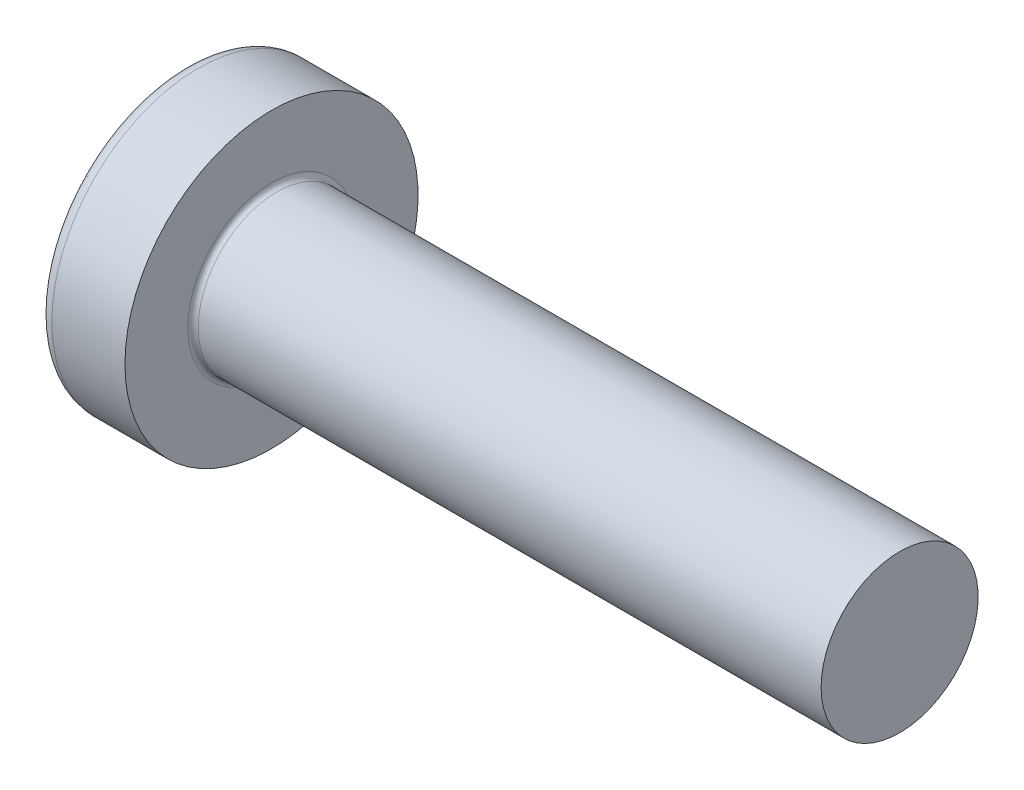
ISO-10303-21;
HEADER;
FILE_DESCRIPTION(('STEP AP214'),'2;1');
FILE_NAME('part.step','',(''),(''),'','','');
FILE_SCHEMA(('AUTOMOTIVE_DESIGN { 1 0 10303 214 1 1 1 1 }'));
ENDSEC;
DATA;
#1=APPLICATION_CONTEXT('core data for automotive mechanical design processes');
#2=APPLICATION_PROTOCOL_DEFINITION('international standard','automotive_design',2000,#1);
#3=PRODUCT_CONTEXT('',#1,'mechanical');
#4=PRODUCT('Part','Part','',(#3));
#5=PRODUCT_RELATED_PRODUCT_CATEGORY('part','',(#4));
#6=PRODUCT_DEFINITION_FORMATION('','',#4);
#7=PRODUCT_DEFINITION_CONTEXT('part definition',#1,'design');
#8=PRODUCT_DEFINITION('design','',#6,#7);
#9=PRODUCT_DEFINITION_SHAPE('','',#8);
#10=(LENGTH_UNIT() NAMED_UNIT(*) SI_UNIT(.MILLI.,.METRE.));
#11=(NAMED_UNIT(*) PLANE_ANGLE_UNIT() SI_UNIT($,.RADIAN.));
#12=(NAMED_UNIT(*) SI_UNIT($,.STERADIAN.) SOLID_ANGLE_UNIT());
#13=UNCERTAINTY_MEASURE_WITH_UNIT(LENGTH_MEASURE(1.E-05),#10,'distance_accuracy_value','');
#14=(GEOMETRIC_REPRESENTATION_CONTEXT(3) GLOBAL_UNCERTAINTY_ASSIGNED_CONTEXT((#13)) GLOBAL_UNIT_ASSIGNED_CONTEXT((#10,
#11,#12)) REPRESENTATION_CONTEXT('',''));
#15=CARTESIAN_POINT('',(0.,0.,0.));
#16=DIRECTION('',(0.,0.,1.));
#17=DIRECTION('',(1.,0.,0.));
#18=AXIS2_PLACEMENT_3D('',#15,#16,#17);
#19=CARTESIAN_POINT('',(5.,0.,0.));
#20=DIRECTION('',(-1.,0.,0.));
#21=DIRECTION('',(0.,1.,0.));
#22=AXIS2_PLACEMENT_3D('',#19,#20,#21);
#23=SPHERICAL_SURFACE('',#22,5.);
#24=CARTESIAN_POINT('',(0.775371598933733,0.,0.));
#25=DIRECTION('',(-1.,0.,0.));
#26=DIRECTION('',(0.,0.,1.));
#27=AXIS2_PLACEMENT_3D('',#24,#25,#26);
#28=CIRCLE('',#27,2.67441860465116);
#29=CARTESIAN_POINT('',(0.775371598933733,0.,2.67441860465116));
#30=VERTEX_POINT('',#29);
#31=EDGE_CURVE('E238',#30,#30,#28,.T.);
#32=ORIENTED_EDGE('',*,*,#31,.T.);
#33=EDGE_LOOP('',(#32));
#34=FACE_BOUND('',#33,.T.);
#35=CARTESIAN_POINT('',(0.0457951200896417,0.,0.));
#36=DIRECTION('',(1.,0.,0.));
#37=DIRECTION('',(0.,0.,-1.));
#38=AXIS2_PLACEMENT_3D('',#35,#36,#37);
#39=CIRCLE('',#38,0.675169614150692);
#40=CARTESIAN_POINT('',(0.0457951200896426,-0.369999999999998,-0.564760133040918));
#41=VERTEX_POINT('',#40);
#42=CARTESIAN_POINT('',(0.0457951200896417,-0.564760133040916,-0.37));
#43=VERTEX_POINT('',#42);
#44=EDGE_CURVE('E374',#41,#43,#39,.F.);
#45=ORIENTED_EDGE('',*,*,#44,.F.);
#46=CARTESIAN_POINT('',(5.,-0.37,0.));
#47=DIRECTION('',(0.,1.,0.));
#48=DIRECTION('',(0.,0.,1.));
#49=AXIS2_PLACEMENT_3D('',#46,#47,#48);
#50=CIRCLE('',#49,4.98629120689917);
#51=CARTESIAN_POINT('',(0.187869734228639,-0.369999999999995,-1.30633162146802));
#52=VERTEX_POINT('',#51);
#53=EDGE_CURVE('E300',#52,#41,#50,.T.);
#54=ORIENTED_EDGE('',*,*,#53,.F.);
#55=CARTESIAN_POINT('',(4.56358262530798,0.,0.875317983305919));
#56=DIRECTION('',(0.446197753347436,0.,-0.894934391398443));
#57=DIRECTION('',(-0.894934391398443,0.,-0.446197753347436));
#58=AXIS2_PLACEMENT_3D('',#55,#56,#57);
#59=CIRCLE('',#58,4.90340272700175);
#60=CARTESIAN_POINT('',(0.18786973422864,0.370000000000005,-1.30633162146802));
#61=VERTEX_POINT('',#60);
#62=EDGE_CURVE('E272',#52,#61,#59,.T.);
#63=ORIENTED_EDGE('',*,*,#62,.T.);
#64=CARTESIAN_POINT('',(5.,0.37,0.));
#65=DIRECTION('',(0.,-1.,0.));
#66=DIRECTION('',(0.,0.,-1.));
#67=AXIS2_PLACEMENT_3D('',#64,#65,#66);
#68=CIRCLE('',#67,4.98629120689917);
#69=CARTESIAN_POINT('',(0.0457951200896425,0.370000000000002,-0.564760133040916));
#70=VERTEX_POINT('',#69);
#71=EDGE_CURVE('E327',#70,#61,#68,.T.);
#72=ORIENTED_EDGE('',*,*,#71,.F.);
#73=CARTESIAN_POINT('',(0.0457951200896417,0.564760133040915,-0.37));
#74=VERTEX_POINT('',#73);
#75=EDGE_CURVE('E393',#74,#70,#39,.F.);
#76=ORIENTED_EDGE('',*,*,#75,.F.);
#77=CARTESIAN_POINT('',(5.,0.,-0.37));
#78=DIRECTION('',(0.,0.,1.));
#79=DIRECTION('',(1.,0.,0.));
#80=AXIS2_PLACEMENT_3D('',#77,#78,#79);
#81=CIRCLE('',#80,4.98629120689917);
#82=CARTESIAN_POINT('',(0.18786973422864,1.30633162146802,-0.37));
#83=VERTEX_POINT('',#82);
#84=EDGE_CURVE('E266',#83,#74,#81,.T.);
#85=ORIENTED_EDGE('',*,*,#84,.F.);
#86=CARTESIAN_POINT('',(4.56358262530798,-0.87531798330592,0.));
#87=DIRECTION('',(0.446197753347436,0.894934391398443,0.));
#88=DIRECTION('',(-0.894934391398442,0.446197753347436,0.));
#89=AXIS2_PLACEMENT_3D('',#86,#87,#88);
#90=CIRCLE('',#89,4.90340272700175);
#91=CARTESIAN_POINT('',(0.18786973422864,1.30633162146802,0.37));
#92=VERTEX_POINT('',#91);
#93=EDGE_CURVE('E269',#83,#92,#90,.T.);
#94=ORIENTED_EDGE('',*,*,#93,.T.);
#95=CARTESIAN_POINT('',(5.,0.,0.37));
#96=DIRECTION('',(0.,0.,-1.));
#97=DIRECTION('',(0.,1.,0.));
#98=AXIS2_PLACEMENT_3D('',#95,#96,#97);
#99=CIRCLE('',#98,4.98629120689917);
#100=CARTESIAN_POINT('',(0.0457951200896417,0.564760133040915,0.37));
#101=VERTEX_POINT('',#100);
#102=EDGE_CURVE('E262',#101,#92,#99,.T.);
#103=ORIENTED_EDGE('',*,*,#102,.F.);
#104=CARTESIAN_POINT('',(0.0457951200896434,0.369999999999998,0.564760133040918));
#105=VERTEX_POINT('',#104);
#106=EDGE_CURVE('E392',#105,#101,#39,.F.);
#107=ORIENTED_EDGE('',*,*,#106,.F.);
#108=CARTESIAN_POINT('',(0.18786973422864,0.369999999999995,1.30633162146802));
#109=VERTEX_POINT('',#108);
#110=EDGE_CURVE('E282',#109,#105,#68,.T.);
#111=ORIENTED_EDGE('',*,*,#110,.F.);
#112=CARTESIAN_POINT('',(4.56358262530798,0.,-0.87531798330592));
#113=DIRECTION('',(0.446197753347436,0.,0.894934391398443));
#114=DIRECTION('',(0.894934391398442,0.,-0.446197753347436));
#115=AXIS2_PLACEMENT_3D('',#112,#113,#114);
#116=CIRCLE('',#115,4.90340272700175);
#117=CARTESIAN_POINT('',(0.18786973422864,-0.370000000000005,1.30633162146802));
#118=VERTEX_POINT('',#117);
#119=EDGE_CURVE('E49',#109,#118,#116,.T.);
#120=ORIENTED_EDGE('',*,*,#119,.T.);
#121=CARTESIAN_POINT('',(0.0457951200896421,-0.370000000000002,0.564760133040916));
#122=VERTEX_POINT('',#121);
#123=EDGE_CURVE('E279',#122,#118,#50,.T.);
#124=ORIENTED_EDGE('',*,*,#123,.F.);
#125=CARTESIAN_POINT('',(0.0457951200896417,-0.564760133040916,0.37));
#126=VERTEX_POINT('',#125);
#127=EDGE_CURVE('E432',#126,#122,#39,.F.);
#128=ORIENTED_EDGE('',*,*,#127,.F.);
#129=CARTESIAN_POINT('',(0.187869734228638,-1.30633162146802,0.37));
#130=VERTEX_POINT('',#129);
#131=EDGE_CURVE('E263',#130,#126,#99,.T.);
#132=ORIENTED_EDGE('',*,*,#131,.F.);
#133=CARTESIAN_POINT('',(4.56358262530798,0.875317983305919,0.));
#134=DIRECTION('',(0.446197753347436,-0.894934391398443,0.));
#135=DIRECTION('',(0.894934391398443,0.446197753347436,0.));
#136=AXIS2_PLACEMENT_3D('',#133,#134,#135);
#137=CIRCLE('',#136,4.90340272700175);
#138=CARTESIAN_POINT('',(0.187869734228639,-1.30633162146802,-0.37));
#139=VERTEX_POINT('',#138);
#140=EDGE_CURVE('E259',#130,#139,#137,.T.);
#141=ORIENTED_EDGE('',*,*,#140,.T.);
#142=EDGE_CURVE('E64',#43,#139,#81,.T.);
#143=ORIENTED_EDGE('',*,*,#142,.F.);
#144=EDGE_LOOP('',(#45,#54,#63,#72,#76,#85,#94,#103,#107,#111,#120,#124,#128,#132,#141,#143));
#145=FACE_BOUND('',#144,.T.);
#146=ADVANCED_FACE('F35',(#34,#145),#23,.T.);
#147=CARTESIAN_POINT('',(1.75,0.527482331818931,-0.37));
#148=DIRECTION('',(0.,0.,1.));
#149=DIRECTION('',(1.,0.,0.));
#150=AXIS2_PLACEMENT_3D('',#147,#148,#149);
#151=PLANE('',#150);
#152=ORIENTED_EDGE('',*,*,#84,.T.);
#153=CARTESIAN_POINT('',(-0.987293237053716,0.649401255967161,-0.37));
#154=CARTESIAN_POINT('',(-0.781914975317084,0.632865887002871,-0.37));
#155=CARTESIAN_POINT('',(-0.576547882393372,0.616188977635081,-0.37));
#156=CARTESIAN_POINT('',(-0.165841599226327,0.582441031964227,-0.37));
#157=CARTESIAN_POINT('',(0.0394975903090452,0.56536998705488,-0.37));
#158=CARTESIAN_POINT('',(0.450133475422572,0.530723441326535,-0.37));
#159=CARTESIAN_POINT('',(0.655430171010573,0.513147940624557,-0.37));
#160=CARTESIAN_POINT('',(1.06596140177934,0.477314957985794,-0.37));
#161=CARTESIAN_POINT('',(1.2711959378071,0.459057485806066,-0.37));
#162=CARTESIAN_POINT('',(1.61065292365626,0.428051938688768,-0.37));
#163=CARTESIAN_POINT('',(1.74490059995643,0.415580824990931,-0.37));
#164=CARTESIAN_POINT('',(2.01334321762763,0.390092023404979,-0.37));
#165=CARTESIAN_POINT('',(2.14753815934577,0.377074339177353,-0.37));
#166=CARTESIAN_POINT('',(2.41586354151957,0.350315629452843,-0.37));
#167=CARTESIAN_POINT('',(2.5499939784531,0.33657456817765,-0.37));
#168=CARTESIAN_POINT('',(2.81814173295471,0.308004077741875,-0.37));
#169=CARTESIAN_POINT('',(2.95215904765134,0.293174621747065,-0.37));
#170=CARTESIAN_POINT('',(3.0860955068368,0.277618485071816,-0.37));
#171=B_SPLINE_CURVE_WITH_KNOTS('',3,(#153,#154,#155,#156,#157,#158,#159,#160,#161,#162,#163,
#164,#165,#166,#167,#168,#169,#170),.UNSPECIFIED.,.F.,.F.,(4,2,2,2,2,2,2,2,4),(0.,
0.618128793984691,1.23627109812525,1.85441325887562,2.4725465791681,2.87702276218609,
3.28149623678161,3.68598973550942,4.09049321032311),.UNSPECIFIED.);
#172=CARTESIAN_POINT('',(1.75,0.415013252800437,-0.370000000000001));
#173=VERTEX_POINT('',#172);
#174=EDGE_CURVE('E416',#74,#173,#171,.T.);
#175=ORIENTED_EDGE('',*,*,#174,.T.);
#176=DIRECTION('',(0.,1.,0.));
#177=VECTOR('',#176,1.);
#178=CARTESIAN_POINT('',(1.75,-0.527482331818931,-0.37));
#179=LINE('',#178,#177);
#180=CARTESIAN_POINT('',(1.75,0.527482331818931,-0.37));
#181=VERTEX_POINT('',#180);
#182=EDGE_CURVE('E356',#173,#181,#179,.T.);
#183=ORIENTED_EDGE('',*,*,#182,.T.);
#184=DIRECTION('',(0.894934391398442,-0.446197753347436,0.));
#185=VECTOR('',#184,1.);
#186=CARTESIAN_POINT('',(0.,1.4,-0.37));
#187=LINE('',#186,#185);
#188=EDGE_CURVE('E239',#83,#181,#187,.T.);
#189=ORIENTED_EDGE('',*,*,#188,.F.);
#190=EDGE_LOOP('',(#152,#175,#183,#189));
#191=FACE_BOUND('',#190,.T.);
#192=ADVANCED_FACE('F194',(#191),#151,.T.);
#193=CARTESIAN_POINT('',(1.75,-0.527482331818931,-0.37));
#194=VERTEX_POINT('',#193);
#195=CARTESIAN_POINT('',(1.75,-0.415013252800437,-0.370000000000001));
#196=VERTEX_POINT('',#195);
#197=EDGE_CURVE('E247',#194,#196,#179,.T.);
#198=ORIENTED_EDGE('',*,*,#197,.T.);
#199=CARTESIAN_POINT('',(-0.987293237053716,-0.649401255967161,-0.37));
#200=CARTESIAN_POINT('',(-0.781914975317084,-0.632865887002871,-0.37));
#201=CARTESIAN_POINT('',(-0.576547882393372,-0.616188977635081,-0.37));
#202=CARTESIAN_POINT('',(-0.165841599226327,-0.582441031964227,-0.37));
#203=CARTESIAN_POINT('',(0.0394975903090452,-0.56536998705488,-0.37));
#204=CARTESIAN_POINT('',(0.450133475422572,-0.530723441326535,-0.37));
#205=CARTESIAN_POINT('',(0.655430171010573,-0.513147940624557,-0.37));
#206=CARTESIAN_POINT('',(1.06596140177934,-0.477314957985794,-0.37));
#207=CARTESIAN_POINT('',(1.2711959378071,-0.459057485806066,-0.37));
#208=CARTESIAN_POINT('',(1.61065292365626,-0.428051938688768,-0.37));
#209=CARTESIAN_POINT('',(1.74490059995643,-0.415580824990931,-0.37));
#210=CARTESIAN_POINT('',(2.01334321762763,-0.390092023404979,-0.37));
#211=CARTESIAN_POINT('',(2.14753815934577,-0.377074339177353,-0.37));
#212=CARTESIAN_POINT('',(2.41586354151957,-0.350315629452843,-0.37));
#213=CARTESIAN_POINT('',(2.5499939784531,-0.33657456817765,-0.37));
#214=CARTESIAN_POINT('',(2.81814173295471,-0.308004077741875,-0.37));
#215=CARTESIAN_POINT('',(2.95215904765134,-0.293174621747065,-0.37));
#216=CARTESIAN_POINT('',(3.0860955068368,-0.277618485071816,-0.37));
#217=B_SPLINE_CURVE_WITH_KNOTS('',3,(#199,#200,#201,#202,#203,#204,#205,#206,#207,#208,#209,
#210,#211,#212,#213,#214,#215,#216),.UNSPECIFIED.,.F.,.F.,(4,2,2,2,2,2,2,2,4),(0.,
0.618128793984691,1.23627109812525,1.85441325887562,2.4725465791681,2.87702276218609,
3.28149623678161,3.68598973550942,4.09049321032311),.UNSPECIFIED.);
#218=EDGE_CURVE('E391',#196,#43,#217,.F.);
#219=ORIENTED_EDGE('',*,*,#218,.T.);
#220=ORIENTED_EDGE('',*,*,#142,.T.);
#221=DIRECTION('',(0.894934391398442,0.446197753347436,0.));
#222=VECTOR('',#221,1.);
#223=CARTESIAN_POINT('',(0.,-1.4,-0.37));
#224=LINE('',#223,#222);
#225=EDGE_CURVE('E330',#139,#194,#224,.T.);
#226=ORIENTED_EDGE('',*,*,#225,.T.);
#227=EDGE_LOOP('',(#198,#219,#220,#226));
#228=FACE_BOUND('',#227,.T.);
#229=ADVANCED_FACE('F200',(#228),#151,.T.);
#230=CARTESIAN_POINT('',(1.75,-0.527482331818931,0.37));
#231=DIRECTION('',(0.,0.,-1.));
#232=DIRECTION('',(0.,1.,0.));
#233=AXIS2_PLACEMENT_3D('',#230,#231,#232);
#234=PLANE('',#233);
#235=DIRECTION('',(0.,-1.,0.));
#236=VECTOR('',#235,1.);
#237=CARTESIAN_POINT('',(1.75,0.527482331818931,0.37));
#238=LINE('',#237,#236);
#239=CARTESIAN_POINT('',(1.75,0.527482331818931,0.37));
#240=VERTEX_POINT('',#239);
#241=CARTESIAN_POINT('',(1.75,0.415013252800437,0.370000000000001));
#242=VERTEX_POINT('',#241);
#243=EDGE_CURVE('E339',#240,#242,#238,.T.);
#244=ORIENTED_EDGE('',*,*,#243,.T.);
#245=CARTESIAN_POINT('',(-0.987293237053716,0.649401255967161,0.37));
#246=CARTESIAN_POINT('',(-0.781914975317084,0.632865887002871,0.37));
#247=CARTESIAN_POINT('',(-0.576547882393372,0.616188977635081,0.37));
#248=CARTESIAN_POINT('',(-0.165841599226327,0.582441031964227,0.37));
#249=CARTESIAN_POINT('',(0.0394975903090453,0.56536998705488,0.37));
#250=CARTESIAN_POINT('',(0.450133475422572,0.530723441326535,0.37));
#251=CARTESIAN_POINT('',(0.655430171010574,0.513147940624557,0.37));
#252=CARTESIAN_POINT('',(1.06596140177934,0.477314957985794,0.37));
#253=CARTESIAN_POINT('',(1.2711959378071,0.459057485806066,0.37));
#254=CARTESIAN_POINT('',(1.61065292365626,0.428051938688768,0.37));
#255=CARTESIAN_POINT('',(1.74490059995643,0.415580824990931,0.37));
#256=CARTESIAN_POINT('',(2.01334321762763,0.39009202340498,0.37));
#257=CARTESIAN_POINT('',(2.14753815934577,0.377074339177353,0.37));
#258=CARTESIAN_POINT('',(2.41586354151957,0.350315629452843,0.37));
#259=CARTESIAN_POINT('',(2.5499939784531,0.33657456817765,0.37));
#260=CARTESIAN_POINT('',(2.81814173295471,0.308004077741875,0.37));
#261=CARTESIAN_POINT('',(2.95215904765134,0.293174621747065,0.37));
#262=CARTESIAN_POINT('',(3.0860955068368,0.277618485071816,0.37));
#263=B_SPLINE_CURVE_WITH_KNOTS('',3,(#245,#246,#247,#248,#249,#250,#251,#252,#253,#254,#255,
#256,#257,#258,#259,#260,#261,#262),.UNSPECIFIED.,.F.,.F.,(4,2,2,2,2,2,2,2,4),(0.,
0.618128793984691,1.23627109812525,1.85441325887562,2.4725465791681,2.87702276218609,
3.28149623678161,3.68598973550942,4.09049321032311),.UNSPECIFIED.);
#264=EDGE_CURVE('E671',#242,#101,#263,.F.);
#265=ORIENTED_EDGE('',*,*,#264,.T.);
#266=ORIENTED_EDGE('',*,*,#102,.T.);
#267=DIRECTION('',(0.894934391398442,-0.446197753347436,0.));
#268=VECTOR('',#267,1.);
#269=CARTESIAN_POINT('',(0.,1.4,0.37));
#270=LINE('',#269,#268);
#271=EDGE_CURVE('E244',#92,#240,#270,.T.);
#272=ORIENTED_EDGE('',*,*,#271,.T.);
#273=EDGE_LOOP('',(#244,#265,#266,#272));
#274=FACE_BOUND('',#273,.T.);
#275=ADVANCED_FACE('F412',(#274),#234,.T.);
#276=ORIENTED_EDGE('',*,*,#131,.T.);
#277=CARTESIAN_POINT('',(-0.987293237069635,-0.649401255968442,0.37));
#278=CARTESIAN_POINT('',(-0.781914975331301,-0.632865887004023,0.37));
#279=CARTESIAN_POINT('',(-0.576547882405888,-0.616188977636102,0.37));
#280=CARTESIAN_POINT('',(-0.16584159923544,-0.582441031964983,0.37));
#281=CARTESIAN_POINT('',(0.0394975903016338,-0.5653699870555,0.37));
#282=CARTESIAN_POINT('',(0.450133475420601,-0.530723441326706,0.37));
#283=CARTESIAN_POINT('',(0.655430171012341,-0.513147940624409,0.37));
#284=CARTESIAN_POINT('',(1.06596140178858,-0.477314957984981,0.37));
#285=CARTESIAN_POINT('',(1.27119593782008,-0.459057485804908,0.37));
#286=CARTESIAN_POINT('',(1.61065292367297,-0.428051938687225,0.37));
#287=CARTESIAN_POINT('',(1.74490059997313,-0.415580824989368,0.37));
#288=CARTESIAN_POINT('',(2.01334321764434,-0.390092023403371,0.37));
#289=CARTESIAN_POINT('',(2.14753815936247,-0.377074339175718,0.37));
#290=CARTESIAN_POINT('',(2.41586354153627,-0.350315629451146,0.37));
#291=CARTESIAN_POINT('',(2.54999397846979,-0.336574568175918,0.37));
#292=CARTESIAN_POINT('',(2.8181417329714,-0.308004077740054,0.37));
#293=CARTESIAN_POINT('',(2.95215904766802,-0.29317462174519,0.37));
#294=CARTESIAN_POINT('',(3.08609550685347,-0.277618485069873,0.37));
#295=B_SPLINE_CURVE_WITH_KNOTS('',3,(#277,#278,#279,#280,#281,#282,#283,#284,#285,#286,#287,
#288,#289,#290,#291,#292,#293,#294),.UNSPECIFIED.,.F.,.F.,(4,2,2,2,2,2,2,2,4),(0.,
0.61812879398981,1.23627109813549,1.85441325889711,2.47254657920086,2.87702276221884,
3.28149623681437,3.68598973554218,4.09049321035586),.UNSPECIFIED.);
#296=CARTESIAN_POINT('',(1.75,-0.415013252800437,0.37));
#297=VERTEX_POINT('',#296);
#298=EDGE_CURVE('E433',#126,#297,#295,.T.);
#299=ORIENTED_EDGE('',*,*,#298,.T.);
#300=CARTESIAN_POINT('',(1.75,-0.527482331818932,0.37));
#301=VERTEX_POINT('',#300);
#302=EDGE_CURVE('E341',#297,#301,#238,.T.);
#303=ORIENTED_EDGE('',*,*,#302,.T.);
#304=DIRECTION('',(0.894934391398443,0.446197753347436,0.));
#305=VECTOR('',#304,1.);
#306=CARTESIAN_POINT('',(0.,-1.4,0.37));
#307=LINE('',#306,#305);
#308=EDGE_CURVE('E332',#130,#301,#307,.T.);
#309=ORIENTED_EDGE('',*,*,#308,.F.);
#310=EDGE_LOOP('',(#276,#299,#303,#309));
#311=FACE_BOUND('',#310,.T.);
#312=ADVANCED_FACE('F519',(#311),#234,.T.);
#313=CARTESIAN_POINT('',(1.75,0.527482331818931,0.37));
#314=DIRECTION('',(0.446197753347436,0.894934391398443,0.));
#315=DIRECTION('',(-0.894934391398442,0.446197753347436,0.));
#316=AXIS2_PLACEMENT_3D('',#313,#314,#315);
#317=PLANE('',#316);
#318=CARTESIAN_POINT('',(2.6696526882832,0.0689604923233249,0.));
#319=DIRECTION('',(0.446197753347436,0.894934391398443,0.));
#320=DIRECTION('',(-0.894934391398443,0.446197753347436,0.));
#321=AXIS2_PLACEMENT_3D('',#318,#319,#320);
#322=ELLIPSE('',#321,1.10195897609154,0.486831694838766);
#323=CARTESIAN_POINT('',(1.75,0.527482331818932,0.175779377683682));
#324=VERTEX_POINT('',#323);
#325=CARTESIAN_POINT('',(1.75,0.527482331818932,-0.175779377683682));
#326=VERTEX_POINT('',#325);
#327=EDGE_CURVE('E305',#324,#326,#322,.F.);
#328=ORIENTED_EDGE('',*,*,#327,.F.);
#329=DIRECTION('',(0.,0.,-1.));
#330=VECTOR('',#329,1.);
#331=CARTESIAN_POINT('',(1.75,0.527482331818931,0.37));
#332=LINE('',#331,#330);
#333=EDGE_CURVE('E342',#240,#324,#332,.T.);
#334=ORIENTED_EDGE('',*,*,#333,.F.);
#335=ORIENTED_EDGE('',*,*,#271,.F.);
#336=ORIENTED_EDGE('',*,*,#93,.F.);
#337=ORIENTED_EDGE('',*,*,#188,.T.);
#338=EDGE_CURVE('E344',#326,#181,#332,.T.);
#339=ORIENTED_EDGE('',*,*,#338,.F.);
#340=EDGE_LOOP('',(#328,#334,#335,#336,#337,#339));
#341=FACE_BOUND('',#340,.T.);
#342=ADVANCED_FACE('F410',(#341),#317,.F.);
#343=CARTESIAN_POINT('',(0.,-1.4,-0.37));
#344=DIRECTION('',(0.446197753347436,-0.894934391398443,0.));
#345=DIRECTION('',(0.894934391398443,0.446197753347436,0.));
#346=AXIS2_PLACEMENT_3D('',#343,#344,#345);
#347=PLANE('',#346);
#348=CARTESIAN_POINT('',(2.6696526882832,-0.0689604923233252,0.));
#349=DIRECTION('',(0.446197753347436,-0.894934391398443,0.));
#350=DIRECTION('',(-0.894934391398443,-0.446197753347436,0.));
#351=AXIS2_PLACEMENT_3D('',#348,#349,#350);
#352=ELLIPSE('',#351,1.10195897609154,0.486831694838766);
#353=CARTESIAN_POINT('',(1.75,-0.527482331818932,-0.175779377683681));
#354=VERTEX_POINT('',#353);
#355=CARTESIAN_POINT('',(1.75,-0.527482331818932,0.17577937768368));
#356=VERTEX_POINT('',#355);
#357=EDGE_CURVE('E673',#354,#356,#352,.F.);
#358=ORIENTED_EDGE('',*,*,#357,.F.);
#359=DIRECTION('',(0.,0.,1.));
#360=VECTOR('',#359,1.);
#361=CARTESIAN_POINT('',(1.75,-0.527482331818931,-0.37));
#362=LINE('',#361,#360);
#363=EDGE_CURVE('E335',#194,#354,#362,.T.);
#364=ORIENTED_EDGE('',*,*,#363,.F.);
#365=ORIENTED_EDGE('',*,*,#225,.F.);
#366=ORIENTED_EDGE('',*,*,#140,.F.);
#367=ORIENTED_EDGE('',*,*,#308,.T.);
#368=EDGE_CURVE('E338',#356,#301,#362,.T.);
#369=ORIENTED_EDGE('',*,*,#368,.F.);
#370=EDGE_LOOP('',(#358,#364,#365,#366,#367,#369));
#371=FACE_BOUND('',#370,.T.);
#372=ADVANCED_FACE('F506',(#371),#347,.F.);
#373=CARTESIAN_POINT('',(1.75,0.527482331818931,-0.37));
#374=DIRECTION('',(-1.,0.,0.));
#375=DIRECTION('',(0.,0.,1.));
#376=AXIS2_PLACEMENT_3D('',#373,#374,#375);
#377=PLANE('',#376);
#378=DIRECTION('',(0.,1.,0.));
#379=VECTOR('',#378,1.);
#380=CARTESIAN_POINT('',(1.75,-0.370000000000002,0.52748233181893));
#381=LINE('',#380,#379);
#382=CARTESIAN_POINT('',(1.75,-0.370000000000002,0.52748233181893));
#383=VERTEX_POINT('',#382);
#384=CARTESIAN_POINT('',(1.75,-0.175779377683686,0.52748233181893));
#385=VERTEX_POINT('',#384);
#386=EDGE_CURVE('E320',#383,#385,#381,.T.);
#387=ORIENTED_EDGE('',*,*,#386,.T.);
#388=CARTESIAN_POINT('',(1.75,0.,0.));
#389=DIRECTION('',(-1.,0.,0.));
#390=DIRECTION('',(0.,0.,1.));
#391=AXIS2_PLACEMENT_3D('',#388,#389,#390);
#392=CIRCLE('',#391,0.556);
#393=CARTESIAN_POINT('',(1.75,-0.370000000000001,0.415013252800436));
#394=VERTEX_POINT('',#393);
#395=EDGE_CURVE('E701',#394,#385,#392,.T.);
#396=ORIENTED_EDGE('',*,*,#395,.F.);
#397=DIRECTION('',(0.,0.,-1.));
#398=VECTOR('',#397,1.);
#399=CARTESIAN_POINT('',(1.75,-0.370000000000002,0.52748233181893));
#400=LINE('',#399,#398);
#401=EDGE_CURVE('E316',#383,#394,#400,.T.);
#402=ORIENTED_EDGE('',*,*,#401,.F.);
#403=EDGE_LOOP('',(#387,#396,#402));
#404=FACE_BOUND('',#403,.T.);
#405=ADVANCED_FACE('F499',(#404),#377,.T.);
#406=ORIENTED_EDGE('',*,*,#302,.F.);
#407=EDGE_CURVE('E706',#356,#297,#392,.T.);
#408=ORIENTED_EDGE('',*,*,#407,.F.);
#409=ORIENTED_EDGE('',*,*,#368,.T.);
#410=EDGE_LOOP('',(#406,#408,#409));
#411=FACE_BOUND('',#410,.T.);
#412=ADVANCED_FACE('F492',(#411),#377,.T.);
#413=ORIENTED_EDGE('',*,*,#363,.T.);
#414=EDGE_CURVE('E385',#196,#354,#392,.T.);
#415=ORIENTED_EDGE('',*,*,#414,.F.);
#416=ORIENTED_EDGE('',*,*,#197,.F.);
#417=EDGE_LOOP('',(#413,#415,#416));
#418=FACE_BOUND('',#417,.T.);
#419=ADVANCED_FACE('F486',(#418),#377,.T.);
#420=CARTESIAN_POINT('',(1.75,-0.369999999999998,-0.415013252800438));
#421=VERTEX_POINT('',#420);
#422=CARTESIAN_POINT('',(1.75,-0.369999999999998,-0.527482331818933));
#423=VERTEX_POINT('',#422);
#424=EDGE_CURVE('E319',#421,#423,#400,.T.);
#425=ORIENTED_EDGE('',*,*,#424,.F.);
#426=CARTESIAN_POINT('',(1.75,-0.17577937768368,-0.527482331818932));
#427=VERTEX_POINT('',#426);
#428=EDGE_CURVE('E56',#427,#421,#392,.T.);
#429=ORIENTED_EDGE('',*,*,#428,.F.);
#430=DIRECTION('',(0.,-1.,0.));
#431=VECTOR('',#430,1.);
#432=CARTESIAN_POINT('',(1.75,0.370000000000002,-0.52748233181893));
#433=LINE('',#432,#431);
#434=EDGE_CURVE('E315',#427,#423,#433,.T.);
#435=ORIENTED_EDGE('',*,*,#434,.T.);
#436=EDGE_LOOP('',(#425,#429,#435));
#437=FACE_BOUND('',#436,.T.);
#438=ADVANCED_FACE('F380',(#437),#377,.T.);
#439=CARTESIAN_POINT('',(1.75,0.370000000000002,-0.52748233181893));
#440=VERTEX_POINT('',#439);
#441=CARTESIAN_POINT('',(1.75,0.175779377683684,-0.527482331818931));
#442=VERTEX_POINT('',#441);
#443=EDGE_CURVE('E312',#440,#442,#433,.T.);
#444=ORIENTED_EDGE('',*,*,#443,.T.);
#445=CARTESIAN_POINT('',(1.75,0.370000000000001,-0.415013252800436));
#446=VERTEX_POINT('',#445);
#447=EDGE_CURVE('E384',#446,#442,#392,.T.);
#448=ORIENTED_EDGE('',*,*,#447,.F.);
#449=DIRECTION('',(0.,0.,1.));
#450=VECTOR('',#449,1.);
#451=CARTESIAN_POINT('',(1.75,0.370000000000002,-0.52748233181893));
#452=LINE('',#451,#450);
#453=EDGE_CURVE('E324',#440,#446,#452,.T.);
#454=ORIENTED_EDGE('',*,*,#453,.F.);
#455=EDGE_LOOP('',(#444,#448,#454));
#456=FACE_BOUND('',#455,.T.);
#457=ADVANCED_FACE('F474',(#456),#377,.T.);
#458=ORIENTED_EDGE('',*,*,#182,.F.);
#459=EDGE_CURVE('E690',#326,#173,#392,.T.);
#460=ORIENTED_EDGE('',*,*,#459,.F.);
#461=ORIENTED_EDGE('',*,*,#338,.T.);
#462=EDGE_LOOP('',(#458,#460,#461));
#463=FACE_BOUND('',#462,.T.);
#464=ADVANCED_FACE('F467',(#463),#377,.T.);
#465=ORIENTED_EDGE('',*,*,#333,.T.);
#466=EDGE_CURVE('E692',#242,#324,#392,.T.);
#467=ORIENTED_EDGE('',*,*,#466,.F.);
#468=ORIENTED_EDGE('',*,*,#243,.F.);
#469=EDGE_LOOP('',(#465,#467,#468));
#470=FACE_BOUND('',#469,.T.);
#471=ADVANCED_FACE('F461',(#470),#377,.T.);
#472=CARTESIAN_POINT('',(1.75,0.369999999999998,0.527482331818932));
#473=DIRECTION('',(0.,-1.,0.));
#474=DIRECTION('',(1.,0.,0.));
#475=AXIS2_PLACEMENT_3D('',#472,#473,#474);
#476=PLANE('',#475);
#477=ORIENTED_EDGE('',*,*,#110,.T.);
#478=CARTESIAN_POINT('',(-0.987293237069635,0.369999999999998,0.649401255968443));
#479=CARTESIAN_POINT('',(-0.781914975331301,0.369999999999998,0.632865887004024));
#480=CARTESIAN_POINT('',(-0.576547882405888,0.369999999999998,0.616188977636103));
#481=CARTESIAN_POINT('',(-0.16584159923544,0.369999999999998,0.582441031964984));
#482=CARTESIAN_POINT('',(0.0394975903016338,0.369999999999998,0.565369987055501));
#483=CARTESIAN_POINT('',(0.450133475420601,0.369999999999998,0.530723441326707));
#484=CARTESIAN_POINT('',(0.655430171012341,0.369999999999998,0.51314794062441));
#485=CARTESIAN_POINT('',(1.06596140178858,0.369999999999998,0.477314957984982));
#486=CARTESIAN_POINT('',(1.27119593782008,0.369999999999998,0.459057485804909));
#487=CARTESIAN_POINT('',(1.61065292367297,0.369999999999999,0.428051938687226));
#488=CARTESIAN_POINT('',(1.74490059997313,0.369999999999999,0.415580824989369));
#489=CARTESIAN_POINT('',(2.01334321764434,0.369999999999999,0.390092023403372));
#490=CARTESIAN_POINT('',(2.14753815936247,0.369999999999999,0.37707433917572));
#491=CARTESIAN_POINT('',(2.41586354153627,0.369999999999999,0.350315629451147));
#492=CARTESIAN_POINT('',(2.54999397846979,0.369999999999999,0.336574568175919));
#493=CARTESIAN_POINT('',(2.8181417329714,0.369999999999999,0.308004077740055));
#494=CARTESIAN_POINT('',(2.95215904766802,0.369999999999999,0.293174621745191));
#495=CARTESIAN_POINT('',(3.08609550685347,0.369999999999999,0.277618485069875));
#496=B_SPLINE_CURVE_WITH_KNOTS('',3,(#478,#479,#480,#481,#482,#483,#484,#485,#486,#487,#488,
#489,#490,#491,#492,#493,#494,#495),.UNSPECIFIED.,.F.,.F.,(4,2,2,2,2,2,2,2,4),(0.,
0.61812879398981,1.23627109813549,1.85441325889711,2.47254657920086,2.87702276221884,
3.28149623681436,3.68598973554218,4.09049321035586),.UNSPECIFIED.);
#497=CARTESIAN_POINT('',(1.75,0.369999999999999,0.415013252800439));
#498=VERTEX_POINT('',#497);
#499=EDGE_CURVE('E670',#105,#498,#496,.T.);
#500=ORIENTED_EDGE('',*,*,#499,.T.);
#501=CARTESIAN_POINT('',(1.75,0.369999999999998,0.527482331818932));
#502=VERTEX_POINT('',#501);
#503=EDGE_CURVE('E297',#498,#502,#452,.T.);
#504=ORIENTED_EDGE('',*,*,#503,.T.);
#505=DIRECTION('',(0.894934391398442,0.,-0.446197753347436));
#506=VECTOR('',#505,1.);
#507=CARTESIAN_POINT('',(0.,0.369999999999995,1.4));
#508=LINE('',#507,#506);
#509=EDGE_CURVE('E290',#109,#502,#508,.T.);
#510=ORIENTED_EDGE('',*,*,#509,.F.);
#511=EDGE_LOOP('',(#477,#500,#504,#510));
#512=FACE_BOUND('',#511,.T.);
#513=ADVANCED_FACE('F294',(#512),#476,.T.);
#514=CARTESIAN_POINT('',(1.75,-0.369999999999998,-0.527482331818933));
#515=DIRECTION('',(0.,1.,0.));
#516=DIRECTION('',(0.,0.,1.));
#517=AXIS2_PLACEMENT_3D('',#514,#515,#516);
#518=PLANE('',#517);
#519=ORIENTED_EDGE('',*,*,#401,.T.);
#520=CARTESIAN_POINT('',(-0.987293237053716,-0.370000000000002,0.64940125596716));
#521=CARTESIAN_POINT('',(-0.781914975317084,-0.370000000000002,0.63286588700287));
#522=CARTESIAN_POINT('',(-0.576547882393372,-0.370000000000002,0.61618897763508));
#523=CARTESIAN_POINT('',(-0.165841599226327,-0.370000000000002,0.582441031964225));
#524=CARTESIAN_POINT('',(0.0394975903090451,-0.370000000000002,0.565369987054878));
#525=CARTESIAN_POINT('',(0.450133475422572,-0.370000000000002,0.530723441326533));
#526=CARTESIAN_POINT('',(0.655430171010573,-0.370000000000002,0.513147940624555));
#527=CARTESIAN_POINT('',(1.06596140177934,-0.370000000000002,0.477314957985793));
#528=CARTESIAN_POINT('',(1.2711959378071,-0.370000000000002,0.459057485806065));
#529=CARTESIAN_POINT('',(1.61065292365626,-0.370000000000001,0.428051938688767));
#530=CARTESIAN_POINT('',(1.74490059995642,-0.370000000000001,0.41558082499093));
#531=CARTESIAN_POINT('',(2.01334321762763,-0.370000000000001,0.390092023404978));
#532=CARTESIAN_POINT('',(2.14753815934577,-0.370000000000001,0.377074339177352));
#533=CARTESIAN_POINT('',(2.41586354151957,-0.370000000000001,0.350315629452841));
#534=CARTESIAN_POINT('',(2.5499939784531,-0.370000000000001,0.336574568177649));
#535=CARTESIAN_POINT('',(2.81814173295471,-0.370000000000001,0.308004077741874));
#536=CARTESIAN_POINT('',(2.95215904765134,-0.370000000000001,0.293174621747063));
#537=CARTESIAN_POINT('',(3.0860955068368,-0.370000000000001,0.277618485071814));
#538=B_SPLINE_CURVE_WITH_KNOTS('',3,(#520,#521,#522,#523,#524,#525,#526,#527,#528,#529,#530,
#531,#532,#533,#534,#535,#536,#537),.UNSPECIFIED.,.F.,.F.,(4,2,2,2,2,2,2,2,4),(0.,
0.618128793984691,1.23627109812525,1.85441325887562,2.4725465791681,2.87702276218609,
3.28149623678161,3.68598973550942,4.09049321032311),.UNSPECIFIED.);
#539=EDGE_CURVE('E425',#394,#122,#538,.F.);
#540=ORIENTED_EDGE('',*,*,#539,.T.);
#541=ORIENTED_EDGE('',*,*,#123,.T.);
#542=DIRECTION('',(0.894934391398442,0.,-0.446197753347436));
#543=VECTOR('',#542,1.);
#544=CARTESIAN_POINT('',(0.,-0.370000000000005,1.4));
#545=LINE('',#544,#543);
#546=EDGE_CURVE('E292',#118,#383,#545,.T.);
#547=ORIENTED_EDGE('',*,*,#546,.T.);
#548=EDGE_LOOP('',(#519,#540,#541,#547));
#549=FACE_BOUND('',#548,.T.);
#550=ADVANCED_FACE('F229',(#549),#518,.T.);
#551=CARTESIAN_POINT('',(1.75,-0.370000000000002,0.52748233181893));
#552=DIRECTION('',(0.446197753347436,0.,0.894934391398443));
#553=DIRECTION('',(-0.894934391398442,0.,0.446197753347436));
#554=AXIS2_PLACEMENT_3D('',#551,#552,#553);
#555=PLANE('',#554);
#556=CARTESIAN_POINT('',(2.6696526882832,0.,0.0689604923233248));
#557=DIRECTION('',(0.446197753347436,0.,0.894934391398443));
#558=DIRECTION('',(-0.894934391398443,0.,0.446197753347436));
#559=AXIS2_PLACEMENT_3D('',#556,#557,#558);
#560=ELLIPSE('',#559,1.10195897609154,0.486831694838766);
#561=CARTESIAN_POINT('',(1.75,0.175779377683682,0.527482331818932));
#562=VERTEX_POINT('',#561);
#563=EDGE_CURVE('E423',#385,#562,#560,.F.);
#564=ORIENTED_EDGE('',*,*,#563,.F.);
#565=ORIENTED_EDGE('',*,*,#386,.F.);
#566=ORIENTED_EDGE('',*,*,#546,.F.);
#567=ORIENTED_EDGE('',*,*,#119,.F.);
#568=ORIENTED_EDGE('',*,*,#509,.T.);
#569=EDGE_CURVE('E323',#562,#502,#381,.T.);
#570=ORIENTED_EDGE('',*,*,#569,.F.);
#571=EDGE_LOOP('',(#564,#565,#566,#567,#568,#570));
#572=FACE_BOUND('',#571,.T.);
#573=ADVANCED_FACE('F288',(#572),#555,.F.);
#574=CARTESIAN_POINT('',(0.,0.370000000000005,-1.4));
#575=DIRECTION('',(0.446197753347436,0.,-0.894934391398443));
#576=DIRECTION('',(0.894934391398443,0.,0.446197753347436));
#577=AXIS2_PLACEMENT_3D('',#574,#575,#576);
#578=PLANE('',#577);
#579=CARTESIAN_POINT('',(2.6696526882832,0.,-0.0689604923233253));
#580=DIRECTION('',(0.446197753347436,0.,-0.894934391398443));
#581=DIRECTION('',(-0.894934391398443,0.,-0.446197753347436));
#582=AXIS2_PLACEMENT_3D('',#579,#580,#581);
#583=ELLIPSE('',#582,1.10195897609154,0.486831694838766);
#584=EDGE_CURVE('E378',#442,#427,#583,.F.);
#585=ORIENTED_EDGE('',*,*,#584,.F.);
#586=ORIENTED_EDGE('',*,*,#443,.F.);
#587=DIRECTION('',(0.894934391398442,0.,0.446197753347436));
#588=VECTOR('',#587,1.);
#589=CARTESIAN_POINT('',(0.,0.370000000000005,-1.4));
#590=LINE('',#589,#588);
#591=EDGE_CURVE('E302',#61,#440,#590,.T.);
#592=ORIENTED_EDGE('',*,*,#591,.F.);
#593=ORIENTED_EDGE('',*,*,#62,.F.);
#594=DIRECTION('',(0.894934391398443,0.,0.446197753347436));
#595=VECTOR('',#594,1.);
#596=CARTESIAN_POINT('',(0.,-0.369999999999995,-1.4));
#597=LINE('',#596,#595);
#598=EDGE_CURVE('E309',#52,#423,#597,.T.);
#599=ORIENTED_EDGE('',*,*,#598,.T.);
#600=ORIENTED_EDGE('',*,*,#434,.F.);
#601=EDGE_LOOP('',(#585,#586,#592,#593,#599,#600));
#602=FACE_BOUND('',#601,.T.);
#603=ADVANCED_FACE('F369',(#602),#578,.F.);
#604=ORIENTED_EDGE('',*,*,#453,.T.);
#605=CARTESIAN_POINT('',(-0.987293237053716,0.370000000000002,-0.649401255967159));
#606=CARTESIAN_POINT('',(-0.781914975317084,0.370000000000002,-0.63286588700287));
#607=CARTESIAN_POINT('',(-0.576547882393372,0.370000000000002,-0.61618897763508));
#608=CARTESIAN_POINT('',(-0.165841599226327,0.370000000000002,-0.582441031964225));
#609=CARTESIAN_POINT('',(0.039497590309045,0.370000000000002,-0.565369987054878));
#610=CARTESIAN_POINT('',(0.450133475422572,0.370000000000002,-0.530723441326533));
#611=CARTESIAN_POINT('',(0.655430171010573,0.370000000000002,-0.513147940624555));
#612=CARTESIAN_POINT('',(1.06596140177934,0.370000000000002,-0.477314957985793));
#613=CARTESIAN_POINT('',(1.2711959378071,0.370000000000002,-0.459057485806065));
#614=CARTESIAN_POINT('',(1.61065292365626,0.370000000000001,-0.428051938688767));
#615=CARTESIAN_POINT('',(1.74490059995642,0.370000000000001,-0.41558082499093));
#616=CARTESIAN_POINT('',(2.01334321762763,0.370000000000001,-0.390092023404978));
#617=CARTESIAN_POINT('',(2.14753815934577,0.370000000000001,-0.377074339177352));
#618=CARTESIAN_POINT('',(2.41586354151957,0.370000000000001,-0.350315629452841));
#619=CARTESIAN_POINT('',(2.5499939784531,0.370000000000001,-0.336574568177649));
#620=CARTESIAN_POINT('',(2.81814173295471,0.370000000000001,-0.308004077741874));
#621=CARTESIAN_POINT('',(2.95215904765134,0.370000000000001,-0.293174621747064));
#622=CARTESIAN_POINT('',(3.0860955068368,0.370000000000001,-0.277618485071814));
#623=B_SPLINE_CURVE_WITH_KNOTS('',3,(#605,#606,#607,#608,#609,#610,#611,#612,#613,#614,#615,
#616,#617,#618,#619,#620,#621,#622),.UNSPECIFIED.,.F.,.F.,(4,2,2,2,2,2,2,2,4),(0.,
0.618128793984691,1.23627109812525,1.85441325887562,2.4725465791681,2.87702276218609,
3.28149623678161,3.68598973550942,4.09049321032311),.UNSPECIFIED.);
#624=EDGE_CURVE('E365',#446,#70,#623,.F.);
#625=ORIENTED_EDGE('',*,*,#624,.T.);
#626=ORIENTED_EDGE('',*,*,#71,.T.);
#627=ORIENTED_EDGE('',*,*,#591,.T.);
#628=EDGE_LOOP('',(#604,#625,#626,#627));
#629=FACE_BOUND('',#628,.T.);
#630=ADVANCED_FACE('F227',(#629),#476,.T.);
#631=ORIENTED_EDGE('',*,*,#53,.T.);
#632=CARTESIAN_POINT('',(-0.987293237069635,-0.369999999999997,-0.649401255968443));
#633=CARTESIAN_POINT('',(-0.781914975331301,-0.369999999999997,-0.632865887004025));
#634=CARTESIAN_POINT('',(-0.576547882405888,-0.369999999999997,-0.616188977636104));
#635=CARTESIAN_POINT('',(-0.16584159923544,-0.369999999999998,-0.582441031964984));
#636=CARTESIAN_POINT('',(0.0394975903016337,-0.369999999999998,-0.565369987055501));
#637=CARTESIAN_POINT('',(0.450133475420601,-0.369999999999998,-0.530723441326707));
#638=CARTESIAN_POINT('',(0.655430171012341,-0.369999999999998,-0.51314794062441));
#639=CARTESIAN_POINT('',(1.06596140178858,-0.369999999999998,-0.477314957984982));
#640=CARTESIAN_POINT('',(1.27119593782008,-0.369999999999998,-0.459057485804909));
#641=CARTESIAN_POINT('',(1.61065292367297,-0.369999999999998,-0.428051938687226));
#642=CARTESIAN_POINT('',(1.74490059997313,-0.369999999999998,-0.415580824989369));
#643=CARTESIAN_POINT('',(2.01334321764434,-0.369999999999999,-0.390092023403372));
#644=CARTESIAN_POINT('',(2.14753815936247,-0.369999999999999,-0.37707433917572));
#645=CARTESIAN_POINT('',(2.41586354153627,-0.369999999999999,-0.350315629451147));
#646=CARTESIAN_POINT('',(2.54999397846979,-0.369999999999999,-0.336574568175919));
#647=CARTESIAN_POINT('',(2.8181417329714,-0.369999999999999,-0.308004077740055));
#648=CARTESIAN_POINT('',(2.95215904766802,-0.369999999999999,-0.293174621745191));
#649=CARTESIAN_POINT('',(3.08609550685347,-0.369999999999999,-0.277618485069875));
#650=B_SPLINE_CURVE_WITH_KNOTS('',3,(#632,#633,#634,#635,#636,#637,#638,#639,#640,#641,#642,
#643,#644,#645,#646,#647,#648,#649),.UNSPECIFIED.,.F.,.F.,(4,2,2,2,2,2,2,2,4),(0.,
0.61812879398981,1.23627109813549,1.85441325889711,2.47254657920086,2.87702276221884,
3.28149623681436,3.68598973554218,4.09049321035586),.UNSPECIFIED.);
#651=EDGE_CURVE('E11',#41,#421,#650,.T.);
#652=ORIENTED_EDGE('',*,*,#651,.T.);
#653=ORIENTED_EDGE('',*,*,#424,.T.);
#654=ORIENTED_EDGE('',*,*,#598,.F.);
#655=EDGE_LOOP('',(#631,#652,#653,#654));
#656=FACE_BOUND('',#655,.T.);
#657=ADVANCED_FACE('F222',(#656),#518,.T.);
#658=CARTESIAN_POINT('',(-25.4,0.,0.));
#659=DIRECTION('',(-1.,0.,0.));
#660=DIRECTION('',(0.,0.,1.));
#661=AXIS2_PLACEMENT_3D('',#658,#659,#660);
#662=CYLINDRICAL_SURFACE('',#661,1.5);
#663=CARTESIAN_POINT('',(2.5,0.,0.));
#664=DIRECTION('',(-1.,0.,0.));
#665=DIRECTION('',(0.,0.,1.));
#666=AXIS2_PLACEMENT_3D('',#663,#664,#665);
#667=CIRCLE('',#666,1.5);
#668=CARTESIAN_POINT('',(2.5,0.,1.5));
#669=VERTEX_POINT('',#668);
#670=EDGE_CURVE('E233',#669,#669,#667,.F.);
#671=ORIENTED_EDGE('',*,*,#670,.T.);
#672=EDGE_LOOP('',(#671));
#673=FACE_BOUND('',#672,.T.);
#674=CARTESIAN_POINT('',(14.4,0.,0.));
#675=DIRECTION('',(-1.,0.,0.));
#676=DIRECTION('',(0.,0.,1.));
#677=AXIS2_PLACEMENT_3D('',#674,#675,#676);
#678=CIRCLE('',#677,1.5);
#679=CARTESIAN_POINT('',(14.4,0.,1.5));
#680=VERTEX_POINT('',#679);
#681=EDGE_CURVE('E236',#680,#680,#678,.T.);
#682=ORIENTED_EDGE('',*,*,#681,.T.);
#683=EDGE_LOOP('',(#682));
#684=FACE_BOUND('',#683,.T.);
#685=ADVANCED_FACE('F219',(#673,#684),#662,.T.);
#686=CARTESIAN_POINT('',(2.4,1.5,0.));
#687=DIRECTION('',(-1.,0.,0.));
#688=DIRECTION('',(0.,0.,1.));
#689=AXIS2_PLACEMENT_3D('',#686,#687,#688);
#690=PLANE('',#689);
#691=CARTESIAN_POINT('',(2.4,0.,0.));
#692=DIRECTION('',(-1.,0.,0.));
#693=DIRECTION('',(0.,0.,1.));
#694=AXIS2_PLACEMENT_3D('',#691,#692,#693);
#695=CIRCLE('',#694,1.6);
#696=CARTESIAN_POINT('',(2.4,0.,1.6));
#697=VERTEX_POINT('',#696);
#698=EDGE_CURVE('E255',#697,#697,#695,.T.);
#699=ORIENTED_EDGE('',*,*,#698,.T.);
#700=EDGE_LOOP('',(#699));
#701=FACE_BOUND('',#700,.T.);
#702=CARTESIAN_POINT('',(2.4,0.,0.));
#703=DIRECTION('',(-1.,0.,0.));
#704=DIRECTION('',(0.,0.,1.));
#705=AXIS2_PLACEMENT_3D('',#702,#703,#704);
#706=CIRCLE('',#705,2.8);
#707=CARTESIAN_POINT('',(2.4,0.,2.8));
#708=VERTEX_POINT('',#707);
#709=EDGE_CURVE('E252',#708,#708,#706,.T.);
#710=ORIENTED_EDGE('',*,*,#709,.F.);
#711=EDGE_LOOP('',(#710));
#712=FACE_BOUND('',#711,.T.);
#713=ADVANCED_FACE('F216',(#701,#712),#690,.F.);
#714=CARTESIAN_POINT('',(-25.4,0.,0.));
#715=DIRECTION('',(-1.,0.,0.));
#716=DIRECTION('',(0.,0.,1.));
#717=AXIS2_PLACEMENT_3D('',#714,#715,#716);
#718=CYLINDRICAL_SURFACE('',#717,2.8);
#719=ORIENTED_EDGE('',*,*,#709,.T.);
#720=EDGE_LOOP('',(#719));
#721=FACE_BOUND('',#720,.T.);
#722=CARTESIAN_POINT('',(1.00350153259131,0.,0.));
#723=DIRECTION('',(-1.,0.,0.));
#724=DIRECTION('',(0.,0.,1.));
#725=AXIS2_PLACEMENT_3D('',#722,#723,#724);
#726=CIRCLE('',#725,2.8);
#727=CARTESIAN_POINT('',(1.00350153259131,0.,2.8));
#728=VERTEX_POINT('',#727);
#729=EDGE_CURVE('E241',#728,#728,#726,.T.);
#730=ORIENTED_EDGE('',*,*,#729,.F.);
#731=EDGE_LOOP('',(#730));
#732=FACE_BOUND('',#731,.T.);
#733=ADVANCED_FACE('F212',(#721,#732),#718,.T.);
#734=CARTESIAN_POINT('',(1.00350153259131,0.,0.));
#735=DIRECTION('',(-1.,0.,0.));
#736=DIRECTION('',(0.,0.,1.));
#737=AXIS2_PLACEMENT_3D('',#734,#735,#736);
#738=TOROIDAL_SURFACE('',#737,2.53,0.27);
#739=ORIENTED_EDGE('',*,*,#729,.T.);
#740=EDGE_LOOP('',(#739));
#741=FACE_BOUND('',#740,.T.);
#742=ORIENTED_EDGE('',*,*,#31,.F.);
#743=EDGE_LOOP('',(#742));
#744=FACE_BOUND('',#743,.T.);
#745=ADVANCED_FACE('F209',(#741,#744),#738,.T.);
#746=CARTESIAN_POINT('',(14.4,1.5,0.));
#747=DIRECTION('',(1.,0.,0.));
#748=DIRECTION('',(0.,0.,-1.));
#749=AXIS2_PLACEMENT_3D('',#746,#747,#748);
#750=PLANE('',#749);
#751=ORIENTED_EDGE('',*,*,#681,.F.);
#752=EDGE_LOOP('',(#751));
#753=FACE_BOUND('',#752,.T.);
#754=ADVANCED_FACE('F207',(#753),#750,.T.);
#755=CARTESIAN_POINT('',(2.5,0.,0.));
#756=DIRECTION('',(-1.,0.,0.));
#757=DIRECTION('',(0.,0.,1.));
#758=AXIS2_PLACEMENT_3D('',#755,#756,#757);
#759=TOROIDAL_SURFACE('',#758,1.6,0.1);
#760=ORIENTED_EDGE('',*,*,#670,.F.);
#761=EDGE_LOOP('',(#760));
#762=FACE_BOUND('',#761,.T.);
#763=ORIENTED_EDGE('',*,*,#698,.F.);
#764=EDGE_LOOP('',(#763));
#765=FACE_BOUND('',#764,.T.);
#766=ADVANCED_FACE('F37',(#762,#765),#759,.F.);
#767=ORIENTED_EDGE('',*,*,#503,.F.);
#768=EDGE_CURVE('E386',#562,#498,#392,.T.);
#769=ORIENTED_EDGE('',*,*,#768,.F.);
#770=ORIENTED_EDGE('',*,*,#569,.T.);
#771=EDGE_LOOP('',(#767,#769,#770));
#772=FACE_BOUND('',#771,.T.);
#773=ADVANCED_FACE('F468',(#772),#377,.T.);
#774=CARTESIAN_POINT('',(1.75,0.,0.));
#775=DIRECTION('',(-1.,0.,0.));
#776=DIRECTION('',(0.,0.,1.));
#777=AXIS2_PLACEMENT_3D('',#774,#775,#776);
#778=CONICAL_SURFACE('',#777,0.556,0.0698131700797659);
#779=ORIENTED_EDGE('',*,*,#327,.T.);
#780=EDGE_CURVE('E687',#324,#326,#392,.T.);
#781=ORIENTED_EDGE('',*,*,#780,.F.);
#782=EDGE_LOOP('',(#779,#781));
#783=FACE_BOUND('',#782,.T.);
#784=ADVANCED_FACE('F191',(#783),#778,.F.);
#785=ORIENTED_EDGE('',*,*,#357,.T.);
#786=EDGE_CURVE('E707',#354,#356,#392,.T.);
#787=ORIENTED_EDGE('',*,*,#786,.F.);
#788=EDGE_LOOP('',(#785,#787));
#789=FACE_BOUND('',#788,.T.);
#790=ADVANCED_FACE('F601',(#789),#778,.F.);
#791=EDGE_CURVE('E388',#498,#242,#392,.T.);
#792=ORIENTED_EDGE('',*,*,#791,.F.);
#793=ORIENTED_EDGE('',*,*,#499,.F.);
#794=ORIENTED_EDGE('',*,*,#106,.T.);
#795=ORIENTED_EDGE('',*,*,#264,.F.);
#796=EDGE_LOOP('',(#792,#793,#794,#795));
#797=FACE_BOUND('',#796,.T.);
#798=ADVANCED_FACE('F607',(#797),#778,.F.);
#799=ORIENTED_EDGE('',*,*,#563,.T.);
#800=EDGE_CURVE('E389',#385,#562,#392,.T.);
#801=ORIENTED_EDGE('',*,*,#800,.F.);
#802=EDGE_LOOP('',(#799,#801));
#803=FACE_BOUND('',#802,.T.);
#804=ADVANCED_FACE('F614',(#803),#778,.F.);
#805=ORIENTED_EDGE('',*,*,#584,.T.);
#806=EDGE_CURVE('E381',#442,#427,#392,.T.);
#807=ORIENTED_EDGE('',*,*,#806,.F.);
#808=EDGE_LOOP('',(#805,#807));
#809=FACE_BOUND('',#808,.T.);
#810=ADVANCED_FACE('F621',(#809),#778,.F.);
#811=ORIENTED_EDGE('',*,*,#127,.T.);
#812=ORIENTED_EDGE('',*,*,#539,.F.);
#813=EDGE_CURVE('E703',#297,#394,#392,.T.);
#814=ORIENTED_EDGE('',*,*,#813,.F.);
#815=ORIENTED_EDGE('',*,*,#298,.F.);
#816=EDGE_LOOP('',(#811,#812,#814,#815));
#817=FACE_BOUND('',#816,.T.);
#818=ADVANCED_FACE('F628',(#817),#778,.F.);
#819=ORIENTED_EDGE('',*,*,#75,.T.);
#820=ORIENTED_EDGE('',*,*,#624,.F.);
#821=EDGE_CURVE('E693',#173,#446,#392,.T.);
#822=ORIENTED_EDGE('',*,*,#821,.F.);
#823=ORIENTED_EDGE('',*,*,#174,.F.);
#824=EDGE_LOOP('',(#819,#820,#822,#823));
#825=FACE_BOUND('',#824,.T.);
#826=ADVANCED_FACE('F189',(#825),#778,.F.);
#827=EDGE_CURVE('E382',#421,#196,#392,.T.);
#828=ORIENTED_EDGE('',*,*,#827,.F.);
#829=ORIENTED_EDGE('',*,*,#651,.F.);
#830=ORIENTED_EDGE('',*,*,#44,.T.);
#831=ORIENTED_EDGE('',*,*,#218,.F.);
#832=EDGE_LOOP('',(#828,#829,#830,#831));
#833=FACE_BOUND('',#832,.T.);
#834=ADVANCED_FACE('F184',(#833),#778,.F.);
#835=CARTESIAN_POINT('',(1.93065535110549,0.,0.));
#836=DIRECTION('',(-1.,0.,0.));
#837=DIRECTION('',(0.,0.,1.));
#838=AXIS2_PLACEMENT_3D('',#835,#836,#837);
#839=CONICAL_SURFACE('',#838,0.,1.25663706143592);
#840=ORIENTED_EDGE('',*,*,#768,.T.);
#841=ORIENTED_EDGE('',*,*,#791,.T.);
#842=ORIENTED_EDGE('',*,*,#466,.T.);
#843=ORIENTED_EDGE('',*,*,#780,.T.);
#844=ORIENTED_EDGE('',*,*,#459,.T.);
#845=ORIENTED_EDGE('',*,*,#821,.T.);
#846=ORIENTED_EDGE('',*,*,#447,.T.);
#847=ORIENTED_EDGE('',*,*,#806,.T.);
#848=ORIENTED_EDGE('',*,*,#428,.T.);
#849=ORIENTED_EDGE('',*,*,#827,.T.);
#850=ORIENTED_EDGE('',*,*,#414,.T.);
#851=ORIENTED_EDGE('',*,*,#786,.T.);
#852=ORIENTED_EDGE('',*,*,#407,.T.);
#853=ORIENTED_EDGE('',*,*,#813,.T.);
#854=ORIENTED_EDGE('',*,*,#395,.T.);
#855=ORIENTED_EDGE('',*,*,#800,.T.);
#856=EDGE_LOOP('',(#840,#841,#842,#843,#844,#845,#846,#847,#848,#849,#850,#851,#852,#853,#854,#855));
#857=FACE_BOUND('',#856,.T.);
#858=CARTESIAN_POINT('',(1.93065535110549,0.,0.));
#859=VERTEX_POINT('',#858);
#860=VERTEX_LOOP('',#859);
#861=FACE_BOUND('',#860,.T.);
#862=ADVANCED_FACE('F182',(#857,#861),#839,.F.);
#863=CLOSED_SHELL('',(#146,#192,#229,#275,#312,#342,#372,#405,#412,#419,#438,#457,#464,#471,
#513,#550,#573,#603,#630,#657,#685,#713,#733,#745,#754,#766,#773,#784,#790,#798,#804,#810,#818,
#826,#834,#862));
#864=MANIFOLD_SOLID_BREP('B2',#863);
#865=ADVANCED_BREP_SHAPE_REPRESENTATION('',(#18,#864),#14);
#866=SHAPE_DEFINITION_REPRESENTATION(#9,#865);
ENDSEC;
END-ISO-10303-21;
